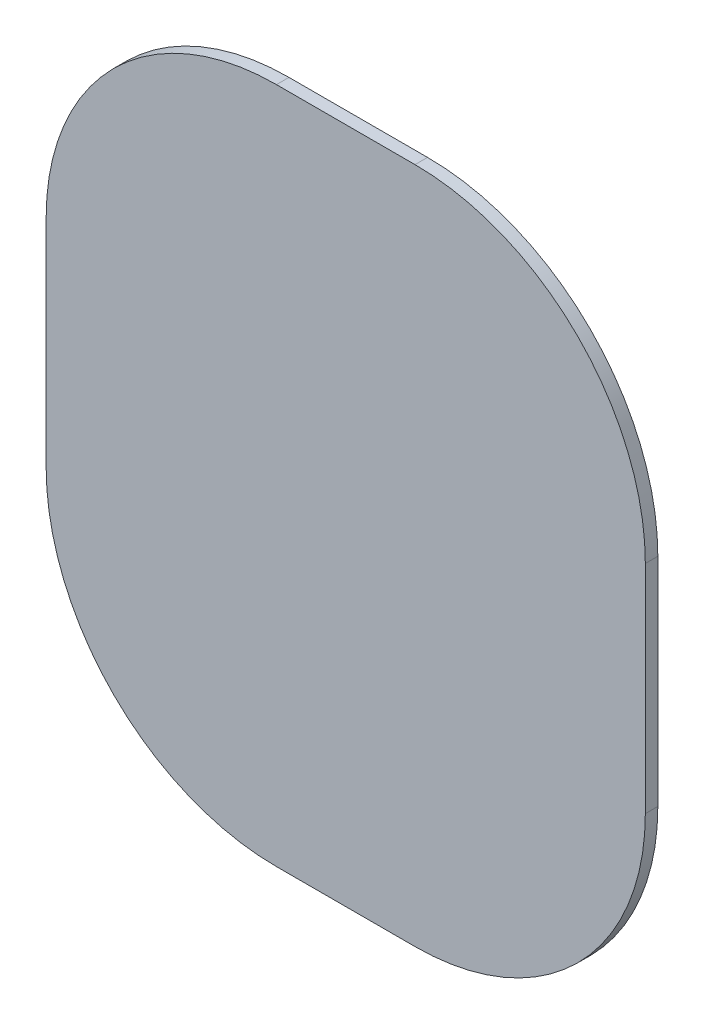
ISO-10303-21;
HEADER;
FILE_DESCRIPTION(('STEP AP214'),'2;1');
FILE_NAME('part.step','',(''),(''),'','','');
FILE_SCHEMA(('AUTOMOTIVE_DESIGN { 1 0 10303 214 1 1 1 1 }'));
ENDSEC;
DATA;
#1=APPLICATION_CONTEXT('core data for automotive mechanical design processes');
#2=APPLICATION_PROTOCOL_DEFINITION('international standard','automotive_design',2000,#1);
#3=PRODUCT_CONTEXT('',#1,'mechanical');
#4=PRODUCT('Part','Part','',(#3));
#5=PRODUCT_RELATED_PRODUCT_CATEGORY('part','',(#4));
#6=PRODUCT_DEFINITION_FORMATION('','',#4);
#7=PRODUCT_DEFINITION_CONTEXT('part definition',#1,'design');
#8=PRODUCT_DEFINITION('design','',#6,#7);
#9=PRODUCT_DEFINITION_SHAPE('','',#8);
#10=(LENGTH_UNIT() NAMED_UNIT(*) SI_UNIT(.MILLI.,.METRE.));
#11=(NAMED_UNIT(*) PLANE_ANGLE_UNIT() SI_UNIT($,.RADIAN.));
#12=(NAMED_UNIT(*) SI_UNIT($,.STERADIAN.) SOLID_ANGLE_UNIT());
#13=UNCERTAINTY_MEASURE_WITH_UNIT(LENGTH_MEASURE(1.E-05),#10,'distance_accuracy_value','');
#14=(GEOMETRIC_REPRESENTATION_CONTEXT(3) GLOBAL_UNCERTAINTY_ASSIGNED_CONTEXT((#13)) GLOBAL_UNIT_ASSIGNED_CONTEXT((#10,
#11,#12)) REPRESENTATION_CONTEXT('',''));
#15=CARTESIAN_POINT('',(0.,0.,0.));
#16=DIRECTION('',(0.,0.,1.));
#17=DIRECTION('',(1.,0.,0.));
#18=AXIS2_PLACEMENT_3D('',#15,#16,#17);
#19=CARTESIAN_POINT('',(198.236322143517,96.6293304832838,15.24));
#20=DIRECTION('',(0.,0.,-1.));
#21=DIRECTION('',(-1.,0.,0.));
#22=AXIS2_PLACEMENT_3D('',#19,#20,#21);
#23=CYLINDRICAL_SURFACE('',#22,116.84);
#24=CARTESIAN_POINT('',(198.236322143517,96.6293304832838,8.89));
#25=DIRECTION('',(0.,0.,1.));
#26=DIRECTION('',(1.,0.,0.));
#27=AXIS2_PLACEMENT_3D('',#24,#25,#26);
#28=CIRCLE('',#27,116.84);
#29=CARTESIAN_POINT('',(315.076322143517,96.6293304832829,8.89));
#30=VERTEX_POINT('',#29);
#31=CARTESIAN_POINT('',(198.236322143516,213.469330483284,8.89));
#32=VERTEX_POINT('',#31);
#33=EDGE_CURVE('E128',#30,#32,#28,.T.);
#34=ORIENTED_EDGE('',*,*,#33,.T.);
#35=DIRECTION('',(0.,0.,-1.));
#36=VECTOR('',#35,1.);
#37=CARTESIAN_POINT('',(198.236322143516,213.469330483284,15.24));
#38=LINE('',#37,#36);
#39=CARTESIAN_POINT('',(198.236322143516,213.469330483284,15.24));
#40=VERTEX_POINT('',#39);
#41=EDGE_CURVE('E11',#40,#32,#38,.T.);
#42=ORIENTED_EDGE('',*,*,#41,.F.);
#43=CARTESIAN_POINT('',(198.236322143517,96.6293304832838,15.24));
#44=DIRECTION('',(0.,0.,1.));
#45=DIRECTION('',(1.,0.,0.));
#46=AXIS2_PLACEMENT_3D('',#43,#44,#45);
#47=CIRCLE('',#46,116.84);
#48=CARTESIAN_POINT('',(315.076322143517,96.6293304832829,15.24));
#49=VERTEX_POINT('',#48);
#50=EDGE_CURVE('E142',#49,#40,#47,.T.);
#51=ORIENTED_EDGE('',*,*,#50,.F.);
#52=DIRECTION('',(0.,0.,-1.));
#53=VECTOR('',#52,1.);
#54=CARTESIAN_POINT('',(315.076322143517,96.6293304832829,15.24));
#55=LINE('',#54,#53);
#56=EDGE_CURVE('E124',#49,#30,#55,.T.);
#57=ORIENTED_EDGE('',*,*,#56,.T.);
#58=EDGE_LOOP('',(#34,#42,#51,#57));
#59=FACE_BOUND('',#58,.T.);
#60=ADVANCED_FACE('F32',(#59),#23,.T.);
#61=CARTESIAN_POINT('',(198.236322143516,213.469330483284,15.24));
#62=DIRECTION('',(0.,-1.,0.));
#63=DIRECTION('',(1.,0.,0.));
#64=AXIS2_PLACEMENT_3D('',#61,#62,#63);
#65=PLANE('',#64);
#66=DIRECTION('',(-1.,0.,0.));
#67=VECTOR('',#66,1.);
#68=CARTESIAN_POINT('',(198.236322143516,213.469330483284,8.89));
#69=LINE('',#68,#67);
#70=CARTESIAN_POINT('',(127.925881087908,213.469330483284,8.89));
#71=VERTEX_POINT('',#70);
#72=EDGE_CURVE('E131',#32,#71,#69,.T.);
#73=ORIENTED_EDGE('',*,*,#72,.T.);
#74=DIRECTION('',(0.,0.,-1.));
#75=VECTOR('',#74,1.);
#76=CARTESIAN_POINT('',(127.925881087908,213.469330483284,15.24));
#77=LINE('',#76,#75);
#78=CARTESIAN_POINT('',(127.925881087908,213.469330483284,15.24));
#79=VERTEX_POINT('',#78);
#80=EDGE_CURVE('E40',#79,#71,#77,.T.);
#81=ORIENTED_EDGE('',*,*,#80,.F.);
#82=DIRECTION('',(-1.,0.,0.));
#83=VECTOR('',#82,1.);
#84=CARTESIAN_POINT('',(198.236322143516,213.469330483284,15.24));
#85=LINE('',#84,#83);
#86=EDGE_CURVE('E91',#40,#79,#85,.T.);
#87=ORIENTED_EDGE('',*,*,#86,.F.);
#88=ORIENTED_EDGE('',*,*,#41,.T.);
#89=EDGE_LOOP('',(#73,#81,#87,#88));
#90=FACE_BOUND('',#89,.T.);
#91=ADVANCED_FACE('F177',(#90),#65,.F.);
#92=CARTESIAN_POINT('',(127.925881087907,96.6293304832838,15.24));
#93=DIRECTION('',(0.,0.,-1.));
#94=DIRECTION('',(-1.,0.,0.));
#95=AXIS2_PLACEMENT_3D('',#92,#93,#94);
#96=CYLINDRICAL_SURFACE('',#95,116.84);
#97=CARTESIAN_POINT('',(127.925881087907,96.6293304832838,8.89));
#98=DIRECTION('',(0.,0.,1.));
#99=DIRECTION('',(1.,0.,0.));
#100=AXIS2_PLACEMENT_3D('',#97,#98,#99);
#101=CIRCLE('',#100,116.84);
#102=CARTESIAN_POINT('',(11.0858810879068,96.6293304832829,8.89));
#103=VERTEX_POINT('',#102);
#104=EDGE_CURVE('E133',#71,#103,#101,.T.);
#105=ORIENTED_EDGE('',*,*,#104,.T.);
#106=DIRECTION('',(0.,0.,-1.));
#107=VECTOR('',#106,1.);
#108=CARTESIAN_POINT('',(11.0858810879068,96.6293304832829,15.24));
#109=LINE('',#108,#107);
#110=CARTESIAN_POINT('',(11.0858810879068,96.6293304832829,15.24));
#111=VERTEX_POINT('',#110);
#112=EDGE_CURVE('E149',#111,#103,#109,.T.);
#113=ORIENTED_EDGE('',*,*,#112,.F.);
#114=CARTESIAN_POINT('',(127.925881087907,96.6293304832838,15.24));
#115=DIRECTION('',(0.,0.,1.));
#116=DIRECTION('',(1.,0.,0.));
#117=AXIS2_PLACEMENT_3D('',#114,#115,#116);
#118=CIRCLE('',#117,116.84);
#119=EDGE_CURVE('E157',#79,#111,#118,.T.);
#120=ORIENTED_EDGE('',*,*,#119,.F.);
#121=ORIENTED_EDGE('',*,*,#80,.T.);
#122=EDGE_LOOP('',(#105,#113,#120,#121));
#123=FACE_BOUND('',#122,.T.);
#124=ADVANCED_FACE('F155',(#123),#96,.T.);
#125=CARTESIAN_POINT('',(11.0858810879068,-13.2856924943543,15.24));
#126=DIRECTION('',(1.,0.,0.));
#127=DIRECTION('',(0.,1.,0.));
#128=AXIS2_PLACEMENT_3D('',#125,#126,#127);
#129=PLANE('',#128);
#130=DIRECTION('',(0.,-1.,0.));
#131=VECTOR('',#130,1.);
#132=CARTESIAN_POINT('',(11.0858810879068,-13.2856924943543,8.89));
#133=LINE('',#132,#131);
#134=CARTESIAN_POINT('',(11.0858810879068,-13.2856924943552,8.89));
#135=VERTEX_POINT('',#134);
#136=EDGE_CURVE('E135',#103,#135,#133,.T.);
#137=ORIENTED_EDGE('',*,*,#136,.T.);
#138=DIRECTION('',(0.,0.,-1.));
#139=VECTOR('',#138,1.);
#140=CARTESIAN_POINT('',(11.0858810879068,-13.2856924943552,15.24));
#141=LINE('',#140,#139);
#142=CARTESIAN_POINT('',(11.0858810879068,-13.2856924943552,15.24));
#143=VERTEX_POINT('',#142);
#144=EDGE_CURVE('E146',#143,#135,#141,.T.);
#145=ORIENTED_EDGE('',*,*,#144,.F.);
#146=DIRECTION('',(0.,-1.,0.));
#147=VECTOR('',#146,1.);
#148=CARTESIAN_POINT('',(11.0858810879068,-13.2856924943543,15.24));
#149=LINE('',#148,#147);
#150=EDGE_CURVE('E169',#111,#143,#149,.T.);
#151=ORIENTED_EDGE('',*,*,#150,.F.);
#152=ORIENTED_EDGE('',*,*,#112,.T.);
#153=EDGE_LOOP('',(#137,#145,#151,#152));
#154=FACE_BOUND('',#153,.T.);
#155=ADVANCED_FACE('F165',(#154),#129,.F.);
#156=CARTESIAN_POINT('',(127.925881087907,-13.2856924943552,15.24));
#157=DIRECTION('',(0.,0.,-1.));
#158=DIRECTION('',(-1.,0.,0.));
#159=AXIS2_PLACEMENT_3D('',#156,#157,#158);
#160=CYLINDRICAL_SURFACE('',#159,116.84);
#161=CARTESIAN_POINT('',(127.925881087907,-13.2856924943552,8.89));
#162=DIRECTION('',(0.,0.,1.));
#163=DIRECTION('',(-1.,0.,0.));
#164=AXIS2_PLACEMENT_3D('',#161,#162,#163);
#165=CIRCLE('',#164,116.84);
#166=CARTESIAN_POINT('',(127.925881087908,-130.125692494355,8.89));
#167=VERTEX_POINT('',#166);
#168=EDGE_CURVE('E137',#135,#167,#165,.T.);
#169=ORIENTED_EDGE('',*,*,#168,.T.);
#170=DIRECTION('',(0.,0.,-1.));
#171=VECTOR('',#170,1.);
#172=CARTESIAN_POINT('',(127.925881087908,-130.125692494355,15.24));
#173=LINE('',#172,#171);
#174=CARTESIAN_POINT('',(127.925881087908,-130.125692494355,15.24));
#175=VERTEX_POINT('',#174);
#176=EDGE_CURVE('E119',#175,#167,#173,.T.);
#177=ORIENTED_EDGE('',*,*,#176,.F.);
#178=CARTESIAN_POINT('',(127.925881087907,-13.2856924943552,15.24));
#179=DIRECTION('',(0.,0.,1.));
#180=DIRECTION('',(-1.,0.,0.));
#181=AXIS2_PLACEMENT_3D('',#178,#179,#180);
#182=CIRCLE('',#181,116.84);
#183=EDGE_CURVE('E110',#143,#175,#182,.T.);
#184=ORIENTED_EDGE('',*,*,#183,.F.);
#185=ORIENTED_EDGE('',*,*,#144,.T.);
#186=EDGE_LOOP('',(#169,#177,#184,#185));
#187=FACE_BOUND('',#186,.T.);
#188=ADVANCED_FACE('F168',(#187),#160,.T.);
#189=CARTESIAN_POINT('',(198.236322143516,-130.125692494355,15.24));
#190=DIRECTION('',(0.,1.,0.));
#191=DIRECTION('',(0.,0.,1.));
#192=AXIS2_PLACEMENT_3D('',#189,#190,#191);
#193=PLANE('',#192);
#194=DIRECTION('',(1.,0.,0.));
#195=VECTOR('',#194,1.);
#196=CARTESIAN_POINT('',(198.236322143516,-130.125692494355,8.89));
#197=LINE('',#196,#195);
#198=CARTESIAN_POINT('',(198.236322143516,-130.125692494355,8.89));
#199=VERTEX_POINT('',#198);
#200=EDGE_CURVE('E118',#167,#199,#197,.T.);
#201=ORIENTED_EDGE('',*,*,#200,.T.);
#202=DIRECTION('',(0.,0.,-1.));
#203=VECTOR('',#202,1.);
#204=CARTESIAN_POINT('',(198.236322143516,-130.125692494355,15.24));
#205=LINE('',#204,#203);
#206=CARTESIAN_POINT('',(198.236322143516,-130.125692494355,15.24));
#207=VERTEX_POINT('',#206);
#208=EDGE_CURVE('E115',#207,#199,#205,.T.);
#209=ORIENTED_EDGE('',*,*,#208,.F.);
#210=DIRECTION('',(1.,0.,0.));
#211=VECTOR('',#210,1.);
#212=CARTESIAN_POINT('',(198.236322143516,-130.125692494355,15.24));
#213=LINE('',#212,#211);
#214=EDGE_CURVE('E104',#175,#207,#213,.T.);
#215=ORIENTED_EDGE('',*,*,#214,.F.);
#216=ORIENTED_EDGE('',*,*,#176,.T.);
#217=EDGE_LOOP('',(#201,#209,#215,#216));
#218=FACE_BOUND('',#217,.T.);
#219=ADVANCED_FACE('F116',(#218),#193,.F.);
#220=CARTESIAN_POINT('',(198.236322143517,-13.2856924943552,15.24));
#221=DIRECTION('',(0.,0.,-1.));
#222=DIRECTION('',(-1.,0.,0.));
#223=AXIS2_PLACEMENT_3D('',#220,#221,#222);
#224=CYLINDRICAL_SURFACE('',#223,116.84);
#225=CARTESIAN_POINT('',(198.236322143517,-13.2856924943552,8.89));
#226=DIRECTION('',(0.,0.,1.));
#227=DIRECTION('',(-1.,0.,0.));
#228=AXIS2_PLACEMENT_3D('',#225,#226,#227);
#229=CIRCLE('',#228,116.84);
#230=CARTESIAN_POINT('',(315.076322143517,-13.2856924943544,8.89));
#231=VERTEX_POINT('',#230);
#232=EDGE_CURVE('E77',#199,#231,#229,.T.);
#233=ORIENTED_EDGE('',*,*,#232,.T.);
#234=DIRECTION('',(0.,0.,-1.));
#235=VECTOR('',#234,1.);
#236=CARTESIAN_POINT('',(315.076322143517,-13.2856924943544,15.24));
#237=LINE('',#236,#235);
#238=CARTESIAN_POINT('',(315.076322143517,-13.2856924943544,15.24));
#239=VERTEX_POINT('',#238);
#240=EDGE_CURVE('E120',#239,#231,#237,.T.);
#241=ORIENTED_EDGE('',*,*,#240,.F.);
#242=CARTESIAN_POINT('',(198.236322143517,-13.2856924943552,15.24));
#243=DIRECTION('',(0.,0.,1.));
#244=DIRECTION('',(-1.,0.,0.));
#245=AXIS2_PLACEMENT_3D('',#242,#243,#244);
#246=CIRCLE('',#245,116.84);
#247=EDGE_CURVE('E108',#207,#239,#246,.T.);
#248=ORIENTED_EDGE('',*,*,#247,.F.);
#249=ORIENTED_EDGE('',*,*,#208,.T.);
#250=EDGE_LOOP('',(#233,#241,#248,#249));
#251=FACE_BOUND('',#250,.T.);
#252=ADVANCED_FACE('F122',(#251),#224,.T.);
#253=CARTESIAN_POINT('',(315.076322143517,96.6293304832829,15.24));
#254=DIRECTION('',(-1.,0.,0.));
#255=DIRECTION('',(0.,0.,1.));
#256=AXIS2_PLACEMENT_3D('',#253,#254,#255);
#257=PLANE('',#256);
#258=DIRECTION('',(0.,1.,0.));
#259=VECTOR('',#258,1.);
#260=CARTESIAN_POINT('',(315.076322143517,96.6293304832829,8.89));
#261=LINE('',#260,#259);
#262=EDGE_CURVE('E83',#231,#30,#261,.T.);
#263=ORIENTED_EDGE('',*,*,#262,.T.);
#264=ORIENTED_EDGE('',*,*,#56,.F.);
#265=DIRECTION('',(0.,1.,0.));
#266=VECTOR('',#265,1.);
#267=CARTESIAN_POINT('',(315.076322143517,96.6293304832829,15.24));
#268=LINE('',#267,#266);
#269=EDGE_CURVE('E48',#239,#49,#268,.T.);
#270=ORIENTED_EDGE('',*,*,#269,.F.);
#271=ORIENTED_EDGE('',*,*,#240,.T.);
#272=EDGE_LOOP('',(#263,#264,#270,#271));
#273=FACE_BOUND('',#272,.T.);
#274=ADVANCED_FACE('F193',(#273),#257,.F.);
#275=CARTESIAN_POINT('',(198.236322143517,96.6293304832838,15.24));
#276=DIRECTION('',(0.,0.,1.));
#277=DIRECTION('',(1.,0.,0.));
#278=AXIS2_PLACEMENT_3D('',#275,#276,#277);
#279=PLANE('',#278);
#280=ORIENTED_EDGE('',*,*,#50,.T.);
#281=ORIENTED_EDGE('',*,*,#86,.T.);
#282=ORIENTED_EDGE('',*,*,#119,.T.);
#283=ORIENTED_EDGE('',*,*,#150,.T.);
#284=ORIENTED_EDGE('',*,*,#183,.T.);
#285=ORIENTED_EDGE('',*,*,#214,.T.);
#286=ORIENTED_EDGE('',*,*,#247,.T.);
#287=ORIENTED_EDGE('',*,*,#269,.T.);
#288=EDGE_LOOP('',(#280,#281,#282,#283,#284,#285,#286,#287));
#289=FACE_BOUND('',#288,.T.);
#290=ADVANCED_FACE('F106',(#289),#279,.T.);
#291=CARTESIAN_POINT('',(198.236322143517,96.6293304832838,8.89));
#292=DIRECTION('',(0.,0.,1.));
#293=DIRECTION('',(1.,0.,0.));
#294=AXIS2_PLACEMENT_3D('',#291,#292,#293);
#295=PLANE('',#294);
#296=ORIENTED_EDGE('',*,*,#33,.F.);
#297=ORIENTED_EDGE('',*,*,#262,.F.);
#298=ORIENTED_EDGE('',*,*,#232,.F.);
#299=ORIENTED_EDGE('',*,*,#200,.F.);
#300=ORIENTED_EDGE('',*,*,#168,.F.);
#301=ORIENTED_EDGE('',*,*,#136,.F.);
#302=ORIENTED_EDGE('',*,*,#104,.F.);
#303=ORIENTED_EDGE('',*,*,#72,.F.);
#304=EDGE_LOOP('',(#296,#297,#298,#299,#300,#301,#302,#303));
#305=FACE_BOUND('',#304,.T.);
#306=ADVANCED_FACE('F161',(#305),#295,.F.);
#307=CLOSED_SHELL('',(#60,#91,#124,#155,#188,#219,#252,#274,#290,#306));
#308=MANIFOLD_SOLID_BREP('B2',#307);
#309=ADVANCED_BREP_SHAPE_REPRESENTATION('',(#18,#308),#14);
#310=SHAPE_DEFINITION_REPRESENTATION(#9,#309);
ENDSEC;
END-ISO-10303-21;
